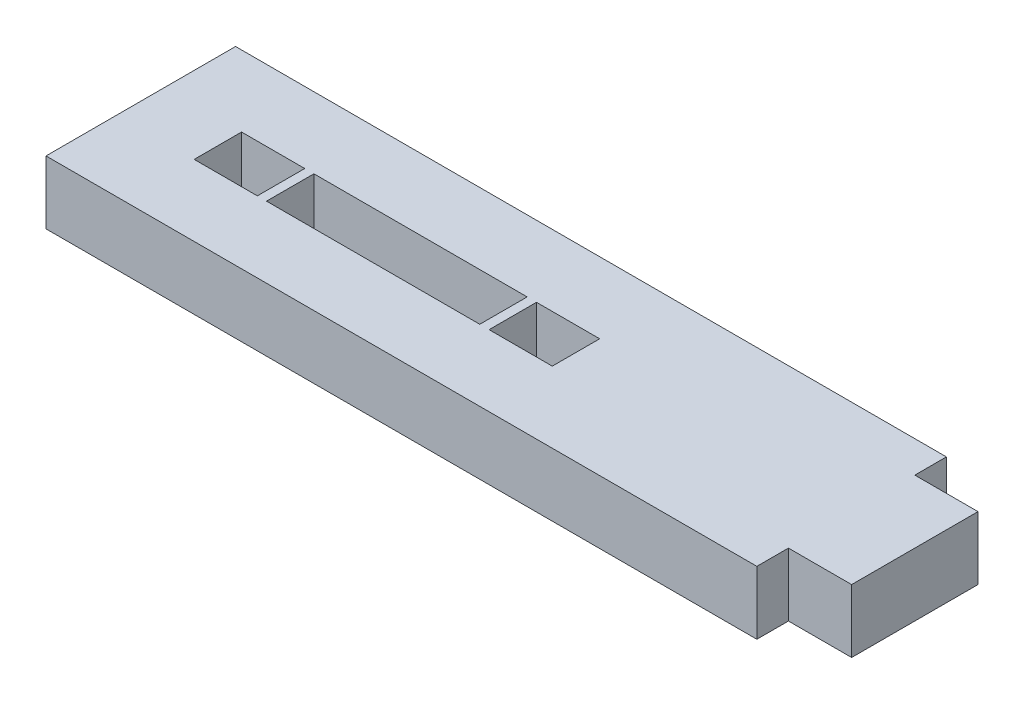
ISO-10303-21;
HEADER;
FILE_DESCRIPTION(('STEP AP214'),'2;1');
FILE_NAME('part.step','',(''),(''),'','','');
FILE_SCHEMA(('AUTOMOTIVE_DESIGN { 1 0 10303 214 1 1 1 1 }'));
ENDSEC;
DATA;
#1=APPLICATION_CONTEXT('core data for automotive mechanical design processes');
#2=APPLICATION_PROTOCOL_DEFINITION('international standard','automotive_design',2000,#1);
#3=PRODUCT_CONTEXT('',#1,'mechanical');
#4=PRODUCT('Part','Part','',(#3));
#5=PRODUCT_RELATED_PRODUCT_CATEGORY('part','',(#4));
#6=PRODUCT_DEFINITION_FORMATION('','',#4);
#7=PRODUCT_DEFINITION_CONTEXT('part definition',#1,'design');
#8=PRODUCT_DEFINITION('design','',#6,#7);
#9=PRODUCT_DEFINITION_SHAPE('','',#8);
#10=(LENGTH_UNIT() NAMED_UNIT(*) SI_UNIT(.MILLI.,.METRE.));
#11=(NAMED_UNIT(*) PLANE_ANGLE_UNIT() SI_UNIT($,.RADIAN.));
#12=(NAMED_UNIT(*) SI_UNIT($,.STERADIAN.) SOLID_ANGLE_UNIT());
#13=UNCERTAINTY_MEASURE_WITH_UNIT(LENGTH_MEASURE(1.E-05),#10,'distance_accuracy_value','');
#14=(GEOMETRIC_REPRESENTATION_CONTEXT(3) GLOBAL_UNCERTAINTY_ASSIGNED_CONTEXT((#13)) GLOBAL_UNIT_ASSIGNED_CONTEXT((#10,
#11,#12)) REPRESENTATION_CONTEXT('',''));
#15=CARTESIAN_POINT('',(0.,0.,0.));
#16=DIRECTION('',(0.,0.,1.));
#17=DIRECTION('',(1.,0.,0.));
#18=AXIS2_PLACEMENT_3D('',#15,#16,#17);
#19=CARTESIAN_POINT('',(0.,4.,0.));
#20=DIRECTION('',(0.,-1.,0.));
#21=DIRECTION('',(0.,0.,-1.));
#22=AXIS2_PLACEMENT_3D('',#19,#20,#21);
#23=PLANE('',#22);
#24=DIRECTION('',(1.,0.,0.));
#25=VECTOR('',#24,1.);
#26=CARTESIAN_POINT('',(1.05,4.,1.5));
#27=LINE('',#26,#25);
#28=CARTESIAN_POINT('',(1.05,4.,1.5));
#29=VERTEX_POINT('',#28);
#30=CARTESIAN_POINT('',(5.05,4.,1.5));
#31=VERTEX_POINT('',#30);
#32=EDGE_CURVE('E205',#29,#31,#27,.T.);
#33=ORIENTED_EDGE('',*,*,#32,.F.);
#34=DIRECTION('',(0.,0.,-1.));
#35=VECTOR('',#34,1.);
#36=CARTESIAN_POINT('',(1.05,4.,1.5));
#37=LINE('',#36,#35);
#38=CARTESIAN_POINT('',(1.05,4.,-1.5));
#39=VERTEX_POINT('',#38);
#40=EDGE_CURVE('E214',#29,#39,#37,.T.);
#41=ORIENTED_EDGE('',*,*,#40,.T.);
#42=DIRECTION('',(1.,0.,0.));
#43=VECTOR('',#42,1.);
#44=CARTESIAN_POINT('',(1.05,4.,-1.5));
#45=LINE('',#44,#43);
#46=CARTESIAN_POINT('',(5.05,4.,-1.5));
#47=VERTEX_POINT('',#46);
#48=EDGE_CURVE('E211',#39,#47,#45,.T.);
#49=ORIENTED_EDGE('',*,*,#48,.T.);
#50=DIRECTION('',(0.,0.,1.));
#51=VECTOR('',#50,1.);
#52=CARTESIAN_POINT('',(5.05,4.,-1.5));
#53=LINE('',#52,#51);
#54=EDGE_CURVE('E207',#47,#31,#53,.T.);
#55=ORIENTED_EDGE('',*,*,#54,.T.);
#56=EDGE_LOOP('',(#33,#41,#49,#55));
#57=FACE_BOUND('',#56,.T.);
#58=DIRECTION('',(0.,0.,-1.));
#59=VECTOR('',#58,1.);
#60=CARTESIAN_POINT('',(22.5,4.,6.));
#61=LINE('',#60,#59);
#62=CARTESIAN_POINT('',(22.5,4.,6.));
#63=VERTEX_POINT('',#62);
#64=CARTESIAN_POINT('',(22.5,4.,4.));
#65=VERTEX_POINT('',#64);
#66=EDGE_CURVE('E297',#63,#65,#61,.T.);
#67=ORIENTED_EDGE('',*,*,#66,.T.);
#68=DIRECTION('',(1.,0.,0.));
#69=VECTOR('',#68,1.);
#70=CARTESIAN_POINT('',(18.5,4.,4.));
#71=LINE('',#70,#69);
#72=CARTESIAN_POINT('',(26.5,4.,4.));
#73=VERTEX_POINT('',#72);
#74=EDGE_CURVE('E276',#65,#73,#71,.T.);
#75=ORIENTED_EDGE('',*,*,#74,.T.);
#76=DIRECTION('',(0.,0.,-1.));
#77=VECTOR('',#76,1.);
#78=CARTESIAN_POINT('',(26.5,4.,4.));
#79=LINE('',#78,#77);
#80=CARTESIAN_POINT('',(26.5,4.,-4.));
#81=VERTEX_POINT('',#80);
#82=EDGE_CURVE('E269',#73,#81,#79,.T.);
#83=ORIENTED_EDGE('',*,*,#82,.T.);
#84=DIRECTION('',(-1.,0.,0.));
#85=VECTOR('',#84,1.);
#86=CARTESIAN_POINT('',(18.5,4.,-4.));
#87=LINE('',#86,#85);
#88=CARTESIAN_POINT('',(22.5,4.,-4.));
#89=VERTEX_POINT('',#88);
#90=EDGE_CURVE('E272',#81,#89,#87,.T.);
#91=ORIENTED_EDGE('',*,*,#90,.T.);
#92=CARTESIAN_POINT('',(22.5,4.,-6.));
#93=VERTEX_POINT('',#92);
#94=EDGE_CURVE('E301',#89,#93,#61,.T.);
#95=ORIENTED_EDGE('',*,*,#94,.T.);
#96=DIRECTION('',(-1.,0.,0.));
#97=VECTOR('',#96,1.);
#98=CARTESIAN_POINT('',(-22.5,4.,-6.));
#99=LINE('',#98,#97);
#100=CARTESIAN_POINT('',(-22.5,4.,-6.));
#101=VERTEX_POINT('',#100);
#102=EDGE_CURVE('E300',#93,#101,#99,.T.);
#103=ORIENTED_EDGE('',*,*,#102,.T.);
#104=DIRECTION('',(0.,0.,1.));
#105=VECTOR('',#104,1.);
#106=CARTESIAN_POINT('',(-22.5,4.,6.));
#107=LINE('',#106,#105);
#108=CARTESIAN_POINT('',(-22.5,4.,6.));
#109=VERTEX_POINT('',#108);
#110=EDGE_CURVE('E303',#101,#109,#107,.T.);
#111=ORIENTED_EDGE('',*,*,#110,.T.);
#112=DIRECTION('',(1.,0.,0.));
#113=VECTOR('',#112,1.);
#114=CARTESIAN_POINT('',(-22.5,4.,6.));
#115=LINE('',#114,#113);
#116=EDGE_CURVE('E305',#109,#63,#115,.T.);
#117=ORIENTED_EDGE('',*,*,#116,.T.);
#118=EDGE_LOOP('',(#67,#75,#83,#91,#95,#103,#111,#117));
#119=FACE_BOUND('',#118,.T.);
#120=DIRECTION('',(1.,0.,0.));
#121=VECTOR('',#120,1.);
#122=CARTESIAN_POINT('',(0.,4.,1.5));
#123=LINE('',#122,#121);
#124=CARTESIAN_POINT('',(-13.04,4.,1.5));
#125=VERTEX_POINT('',#124);
#126=CARTESIAN_POINT('',(0.460000000000004,4.,1.5));
#127=VERTEX_POINT('',#126);
#128=EDGE_CURVE('E237',#125,#127,#123,.T.);
#129=ORIENTED_EDGE('',*,*,#128,.F.);
#130=DIRECTION('',(0.,0.,-1.));
#131=VECTOR('',#130,1.);
#132=CARTESIAN_POINT('',(-13.04,4.,0.));
#133=LINE('',#132,#131);
#134=CARTESIAN_POINT('',(-13.04,4.,-1.5));
#135=VERTEX_POINT('',#134);
#136=EDGE_CURVE('E245',#125,#135,#133,.T.);
#137=ORIENTED_EDGE('',*,*,#136,.T.);
#138=DIRECTION('',(1.,0.,0.));
#139=VECTOR('',#138,1.);
#140=CARTESIAN_POINT('',(0.,4.,-1.5));
#141=LINE('',#140,#139);
#142=CARTESIAN_POINT('',(0.460000000000004,4.,-1.5));
#143=VERTEX_POINT('',#142);
#144=EDGE_CURVE('E242',#135,#143,#141,.T.);
#145=ORIENTED_EDGE('',*,*,#144,.T.);
#146=DIRECTION('',(0.,0.,-1.));
#147=VECTOR('',#146,1.);
#148=CARTESIAN_POINT('',(0.460000000000004,4.,0.));
#149=LINE('',#148,#147);
#150=EDGE_CURVE('E239',#127,#143,#149,.T.);
#151=ORIENTED_EDGE('',*,*,#150,.F.);
#152=EDGE_LOOP('',(#129,#137,#145,#151));
#153=FACE_BOUND('',#152,.T.);
#154=DIRECTION('',(1.,0.,0.));
#155=VECTOR('',#154,1.);
#156=CARTESIAN_POINT('',(-17.62,4.,1.5));
#157=LINE('',#156,#155);
#158=CARTESIAN_POINT('',(-17.62,4.,1.5));
#159=VERTEX_POINT('',#158);
#160=CARTESIAN_POINT('',(-13.62,4.,1.5));
#161=VERTEX_POINT('',#160);
#162=EDGE_CURVE('E168',#159,#161,#157,.T.);
#163=ORIENTED_EDGE('',*,*,#162,.F.);
#164=DIRECTION('',(0.,0.,-1.));
#165=VECTOR('',#164,1.);
#166=CARTESIAN_POINT('',(-17.62,4.,1.5));
#167=LINE('',#166,#165);
#168=CARTESIAN_POINT('',(-17.62,4.,-1.5));
#169=VERTEX_POINT('',#168);
#170=EDGE_CURVE('E190',#159,#169,#167,.T.);
#171=ORIENTED_EDGE('',*,*,#170,.T.);
#172=DIRECTION('',(1.,0.,0.));
#173=VECTOR('',#172,1.);
#174=CARTESIAN_POINT('',(-17.62,4.,-1.5));
#175=LINE('',#174,#173);
#176=CARTESIAN_POINT('',(-13.62,4.,-1.5));
#177=VERTEX_POINT('',#176);
#178=EDGE_CURVE('E48',#169,#177,#175,.T.);
#179=ORIENTED_EDGE('',*,*,#178,.T.);
#180=DIRECTION('',(0.,0.,1.));
#181=VECTOR('',#180,1.);
#182=CARTESIAN_POINT('',(-13.62,4.,-1.5));
#183=LINE('',#182,#181);
#184=EDGE_CURVE('E178',#177,#161,#183,.T.);
#185=ORIENTED_EDGE('',*,*,#184,.T.);
#186=EDGE_LOOP('',(#163,#171,#179,#185));
#187=FACE_BOUND('',#186,.T.);
#188=ADVANCED_FACE('F33',(#57,#119,#153,#187),#23,.F.);
#189=CARTESIAN_POINT('',(0.,0.,0.));
#190=DIRECTION('',(0.,-1.,0.));
#191=DIRECTION('',(0.,0.,-1.));
#192=AXIS2_PLACEMENT_3D('',#189,#190,#191);
#193=PLANE('',#192);
#194=DIRECTION('',(0.,0.,-1.));
#195=VECTOR('',#194,1.);
#196=CARTESIAN_POINT('',(22.5,0.,6.));
#197=LINE('',#196,#195);
#198=CARTESIAN_POINT('',(22.5,0.,-4.));
#199=VERTEX_POINT('',#198);
#200=CARTESIAN_POINT('',(22.5,0.,-6.));
#201=VERTEX_POINT('',#200);
#202=EDGE_CURVE('E296',#199,#201,#197,.T.);
#203=ORIENTED_EDGE('',*,*,#202,.F.);
#204=DIRECTION('',(-1.,0.,0.));
#205=VECTOR('',#204,1.);
#206=CARTESIAN_POINT('',(18.5,0.,-4.));
#207=LINE('',#206,#205);
#208=CARTESIAN_POINT('',(26.5,0.,-4.));
#209=VERTEX_POINT('',#208);
#210=EDGE_CURVE('E281',#209,#199,#207,.T.);
#211=ORIENTED_EDGE('',*,*,#210,.F.);
#212=DIRECTION('',(0.,0.,-1.));
#213=VECTOR('',#212,1.);
#214=CARTESIAN_POINT('',(26.5,0.,4.));
#215=LINE('',#214,#213);
#216=CARTESIAN_POINT('',(26.5,0.,4.));
#217=VERTEX_POINT('',#216);
#218=EDGE_CURVE('E268',#217,#209,#215,.T.);
#219=ORIENTED_EDGE('',*,*,#218,.F.);
#220=DIRECTION('',(1.,0.,0.));
#221=VECTOR('',#220,1.);
#222=CARTESIAN_POINT('',(18.5,0.,4.));
#223=LINE('',#222,#221);
#224=CARTESIAN_POINT('',(22.5,0.,4.));
#225=VERTEX_POINT('',#224);
#226=EDGE_CURVE('E273',#225,#217,#223,.T.);
#227=ORIENTED_EDGE('',*,*,#226,.F.);
#228=CARTESIAN_POINT('',(22.5,0.,6.));
#229=VERTEX_POINT('',#228);
#230=EDGE_CURVE('E308',#229,#225,#197,.T.);
#231=ORIENTED_EDGE('',*,*,#230,.F.);
#232=DIRECTION('',(1.,0.,0.));
#233=VECTOR('',#232,1.);
#234=CARTESIAN_POINT('',(-22.5,0.,6.));
#235=LINE('',#234,#233);
#236=CARTESIAN_POINT('',(-22.5,0.,6.));
#237=VERTEX_POINT('',#236);
#238=EDGE_CURVE('E314',#237,#229,#235,.T.);
#239=ORIENTED_EDGE('',*,*,#238,.F.);
#240=DIRECTION('',(0.,0.,1.));
#241=VECTOR('',#240,1.);
#242=CARTESIAN_POINT('',(-22.5,0.,6.));
#243=LINE('',#242,#241);
#244=CARTESIAN_POINT('',(-22.5,0.,-6.));
#245=VERTEX_POINT('',#244);
#246=EDGE_CURVE('E312',#245,#237,#243,.T.);
#247=ORIENTED_EDGE('',*,*,#246,.F.);
#248=DIRECTION('',(-1.,0.,0.));
#249=VECTOR('',#248,1.);
#250=CARTESIAN_POINT('',(-22.5,0.,-6.));
#251=LINE('',#250,#249);
#252=EDGE_CURVE('E310',#201,#245,#251,.T.);
#253=ORIENTED_EDGE('',*,*,#252,.F.);
#254=EDGE_LOOP('',(#203,#211,#219,#227,#231,#239,#247,#253));
#255=FACE_BOUND('',#254,.T.);
#256=DIRECTION('',(0.,0.,-1.));
#257=VECTOR('',#256,1.);
#258=CARTESIAN_POINT('',(-13.04,0.,0.));
#259=LINE('',#258,#257);
#260=CARTESIAN_POINT('',(-13.04,0.,1.5));
#261=VERTEX_POINT('',#260);
#262=CARTESIAN_POINT('',(-13.04,0.,-1.5));
#263=VERTEX_POINT('',#262);
#264=EDGE_CURVE('E240',#261,#263,#259,.T.);
#265=ORIENTED_EDGE('',*,*,#264,.F.);
#266=DIRECTION('',(1.,0.,0.));
#267=VECTOR('',#266,1.);
#268=CARTESIAN_POINT('',(0.,0.,1.5));
#269=LINE('',#268,#267);
#270=CARTESIAN_POINT('',(0.460000000000004,0.,1.5));
#271=VERTEX_POINT('',#270);
#272=EDGE_CURVE('E236',#261,#271,#269,.T.);
#273=ORIENTED_EDGE('',*,*,#272,.T.);
#274=DIRECTION('',(0.,0.,-1.));
#275=VECTOR('',#274,1.);
#276=CARTESIAN_POINT('',(0.460000000000004,0.,0.));
#277=LINE('',#276,#275);
#278=CARTESIAN_POINT('',(0.460000000000004,0.,-1.5));
#279=VERTEX_POINT('',#278);
#280=EDGE_CURVE('E251',#271,#279,#277,.T.);
#281=ORIENTED_EDGE('',*,*,#280,.T.);
#282=DIRECTION('',(1.,0.,0.));
#283=VECTOR('',#282,1.);
#284=CARTESIAN_POINT('',(0.,0.,-1.5));
#285=LINE('',#284,#283);
#286=EDGE_CURVE('E254',#263,#279,#285,.T.);
#287=ORIENTED_EDGE('',*,*,#286,.F.);
#288=EDGE_LOOP('',(#265,#273,#281,#287));
#289=FACE_BOUND('',#288,.T.);
#290=DIRECTION('',(0.,0.,-1.));
#291=VECTOR('',#290,1.);
#292=CARTESIAN_POINT('',(1.05,0.,1.5));
#293=LINE('',#292,#291);
#294=CARTESIAN_POINT('',(1.05,0.,1.5));
#295=VERTEX_POINT('',#294);
#296=CARTESIAN_POINT('',(1.05,0.,-1.5));
#297=VERTEX_POINT('',#296);
#298=EDGE_CURVE('E208',#295,#297,#293,.T.);
#299=ORIENTED_EDGE('',*,*,#298,.F.);
#300=DIRECTION('',(1.,0.,0.));
#301=VECTOR('',#300,1.);
#302=CARTESIAN_POINT('',(1.05,0.,1.5));
#303=LINE('',#302,#301);
#304=CARTESIAN_POINT('',(5.05,0.,1.5));
#305=VERTEX_POINT('',#304);
#306=EDGE_CURVE('E186',#295,#305,#303,.T.);
#307=ORIENTED_EDGE('',*,*,#306,.T.);
#308=DIRECTION('',(0.,0.,1.));
#309=VECTOR('',#308,1.);
#310=CARTESIAN_POINT('',(5.05,0.,-1.5));
#311=LINE('',#310,#309);
#312=CARTESIAN_POINT('',(5.05,0.,-1.5));
#313=VERTEX_POINT('',#312);
#314=EDGE_CURVE('E220',#313,#305,#311,.T.);
#315=ORIENTED_EDGE('',*,*,#314,.F.);
#316=DIRECTION('',(1.,0.,0.));
#317=VECTOR('',#316,1.);
#318=CARTESIAN_POINT('',(1.05,0.,-1.5));
#319=LINE('',#318,#317);
#320=EDGE_CURVE('E223',#297,#313,#319,.T.);
#321=ORIENTED_EDGE('',*,*,#320,.F.);
#322=EDGE_LOOP('',(#299,#307,#315,#321));
#323=FACE_BOUND('',#322,.T.);
#324=DIRECTION('',(0.,0.,-1.));
#325=VECTOR('',#324,1.);
#326=CARTESIAN_POINT('',(-17.62,0.,1.5));
#327=LINE('',#326,#325);
#328=CARTESIAN_POINT('',(-17.62,0.,1.5));
#329=VERTEX_POINT('',#328);
#330=CARTESIAN_POINT('',(-17.62,0.,-1.5));
#331=VERTEX_POINT('',#330);
#332=EDGE_CURVE('E179',#329,#331,#327,.T.);
#333=ORIENTED_EDGE('',*,*,#332,.F.);
#334=DIRECTION('',(1.,0.,0.));
#335=VECTOR('',#334,1.);
#336=CARTESIAN_POINT('',(-17.62,0.,1.5));
#337=LINE('',#336,#335);
#338=CARTESIAN_POINT('',(-13.62,0.,1.5));
#339=VERTEX_POINT('',#338);
#340=EDGE_CURVE('E56',#329,#339,#337,.T.);
#341=ORIENTED_EDGE('',*,*,#340,.T.);
#342=DIRECTION('',(0.,0.,1.));
#343=VECTOR('',#342,1.);
#344=CARTESIAN_POINT('',(-13.62,0.,-1.5));
#345=LINE('',#344,#343);
#346=CARTESIAN_POINT('',(-13.62,0.,-1.5));
#347=VERTEX_POINT('',#346);
#348=EDGE_CURVE('E185',#347,#339,#345,.T.);
#349=ORIENTED_EDGE('',*,*,#348,.F.);
#350=DIRECTION('',(1.,0.,0.));
#351=VECTOR('',#350,1.);
#352=CARTESIAN_POINT('',(-17.62,0.,-1.5));
#353=LINE('',#352,#351);
#354=EDGE_CURVE('E196',#331,#347,#353,.T.);
#355=ORIENTED_EDGE('',*,*,#354,.F.);
#356=EDGE_LOOP('',(#333,#341,#349,#355));
#357=FACE_BOUND('',#356,.T.);
#358=ADVANCED_FACE('F332',(#255,#289,#323,#357),#193,.T.);
#359=CARTESIAN_POINT('',(22.5,4.,6.));
#360=DIRECTION('',(-1.,0.,0.));
#361=DIRECTION('',(0.,0.,1.));
#362=AXIS2_PLACEMENT_3D('',#359,#360,#361);
#363=PLANE('',#362);
#364=DIRECTION('',(0.,1.,0.));
#365=VECTOR('',#364,1.);
#366=CARTESIAN_POINT('',(22.5,4.,-4.));
#367=LINE('',#366,#365);
#368=EDGE_CURVE('E293',#199,#89,#367,.T.);
#369=ORIENTED_EDGE('',*,*,#368,.F.);
#370=ORIENTED_EDGE('',*,*,#202,.T.);
#371=DIRECTION('',(0.,-1.,0.));
#372=VECTOR('',#371,1.);
#373=CARTESIAN_POINT('',(22.5,4.,-6.));
#374=LINE('',#373,#372);
#375=EDGE_CURVE('E11',#93,#201,#374,.T.);
#376=ORIENTED_EDGE('',*,*,#375,.F.);
#377=ORIENTED_EDGE('',*,*,#94,.F.);
#378=EDGE_LOOP('',(#369,#370,#376,#377));
#379=FACE_BOUND('',#378,.T.);
#380=ADVANCED_FACE('F35',(#379),#363,.F.);
#381=DIRECTION('',(0.,-1.,0.));
#382=VECTOR('',#381,1.);
#383=CARTESIAN_POINT('',(22.5,4.,4.));
#384=LINE('',#383,#382);
#385=EDGE_CURVE('E290',#65,#225,#384,.T.);
#386=ORIENTED_EDGE('',*,*,#385,.F.);
#387=ORIENTED_EDGE('',*,*,#66,.F.);
#388=DIRECTION('',(0.,-1.,0.));
#389=VECTOR('',#388,1.);
#390=CARTESIAN_POINT('',(22.5,4.,6.));
#391=LINE('',#390,#389);
#392=EDGE_CURVE('E307',#63,#229,#391,.T.);
#393=ORIENTED_EDGE('',*,*,#392,.T.);
#394=ORIENTED_EDGE('',*,*,#230,.T.);
#395=EDGE_LOOP('',(#386,#387,#393,#394));
#396=FACE_BOUND('',#395,.T.);
#397=ADVANCED_FACE('F342',(#396),#363,.F.);
#398=CARTESIAN_POINT('',(-22.5,4.,-6.));
#399=DIRECTION('',(0.,0.,1.));
#400=DIRECTION('',(1.,0.,0.));
#401=AXIS2_PLACEMENT_3D('',#398,#399,#400);
#402=PLANE('',#401);
#403=ORIENTED_EDGE('',*,*,#252,.T.);
#404=DIRECTION('',(0.,-1.,0.));
#405=VECTOR('',#404,1.);
#406=CARTESIAN_POINT('',(-22.5,4.,-6.));
#407=LINE('',#406,#405);
#408=EDGE_CURVE('E41',#101,#245,#407,.T.);
#409=ORIENTED_EDGE('',*,*,#408,.F.);
#410=ORIENTED_EDGE('',*,*,#102,.F.);
#411=ORIENTED_EDGE('',*,*,#375,.T.);
#412=EDGE_LOOP('',(#403,#409,#410,#411));
#413=FACE_BOUND('',#412,.T.);
#414=ADVANCED_FACE('F359',(#413),#402,.F.);
#415=CARTESIAN_POINT('',(-22.5,4.,6.));
#416=DIRECTION('',(1.,0.,0.));
#417=DIRECTION('',(0.,0.,-1.));
#418=AXIS2_PLACEMENT_3D('',#415,#416,#417);
#419=PLANE('',#418);
#420=ORIENTED_EDGE('',*,*,#246,.T.);
#421=DIRECTION('',(0.,-1.,0.));
#422=VECTOR('',#421,1.);
#423=CARTESIAN_POINT('',(-22.5,4.,6.));
#424=LINE('',#423,#422);
#425=EDGE_CURVE('E318',#109,#237,#424,.T.);
#426=ORIENTED_EDGE('',*,*,#425,.F.);
#427=ORIENTED_EDGE('',*,*,#110,.F.);
#428=ORIENTED_EDGE('',*,*,#408,.T.);
#429=EDGE_LOOP('',(#420,#426,#427,#428));
#430=FACE_BOUND('',#429,.T.);
#431=ADVANCED_FACE('F325',(#430),#419,.F.);
#432=CARTESIAN_POINT('',(-22.5,4.,6.));
#433=DIRECTION('',(0.,0.,-1.));
#434=DIRECTION('',(-1.,0.,0.));
#435=AXIS2_PLACEMENT_3D('',#432,#433,#434);
#436=PLANE('',#435);
#437=ORIENTED_EDGE('',*,*,#238,.T.);
#438=ORIENTED_EDGE('',*,*,#392,.F.);
#439=ORIENTED_EDGE('',*,*,#116,.F.);
#440=ORIENTED_EDGE('',*,*,#425,.T.);
#441=EDGE_LOOP('',(#437,#438,#439,#440));
#442=FACE_BOUND('',#441,.T.);
#443=ADVANCED_FACE('F338',(#442),#436,.F.);
#444=CARTESIAN_POINT('',(18.5,4.,-4.));
#445=DIRECTION('',(0.,0.,1.));
#446=DIRECTION('',(1.,0.,0.));
#447=AXIS2_PLACEMENT_3D('',#444,#445,#446);
#448=PLANE('',#447);
#449=ORIENTED_EDGE('',*,*,#210,.T.);
#450=ORIENTED_EDGE('',*,*,#368,.T.);
#451=ORIENTED_EDGE('',*,*,#90,.F.);
#452=DIRECTION('',(0.,-1.,0.));
#453=VECTOR('',#452,1.);
#454=CARTESIAN_POINT('',(26.5,4.,-4.));
#455=LINE('',#454,#453);
#456=EDGE_CURVE('E287',#81,#209,#455,.T.);
#457=ORIENTED_EDGE('',*,*,#456,.T.);
#458=EDGE_LOOP('',(#449,#450,#451,#457));
#459=FACE_BOUND('',#458,.T.);
#460=ADVANCED_FACE('F355',(#459),#448,.F.);
#461=CARTESIAN_POINT('',(18.5,4.,4.));
#462=DIRECTION('',(0.,0.,-1.));
#463=DIRECTION('',(-1.,0.,0.));
#464=AXIS2_PLACEMENT_3D('',#461,#462,#463);
#465=PLANE('',#464);
#466=ORIENTED_EDGE('',*,*,#74,.F.);
#467=ORIENTED_EDGE('',*,*,#385,.T.);
#468=ORIENTED_EDGE('',*,*,#226,.T.);
#469=DIRECTION('',(0.,-1.,0.));
#470=VECTOR('',#469,1.);
#471=CARTESIAN_POINT('',(26.5,4.,4.));
#472=LINE('',#471,#470);
#473=EDGE_CURVE('E278',#73,#217,#472,.T.);
#474=ORIENTED_EDGE('',*,*,#473,.F.);
#475=EDGE_LOOP('',(#466,#467,#468,#474));
#476=FACE_BOUND('',#475,.T.);
#477=ADVANCED_FACE('F348',(#476),#465,.F.);
#478=CARTESIAN_POINT('',(26.5,4.,4.));
#479=DIRECTION('',(-1.,0.,0.));
#480=DIRECTION('',(0.,0.,1.));
#481=AXIS2_PLACEMENT_3D('',#478,#479,#480);
#482=PLANE('',#481);
#483=ORIENTED_EDGE('',*,*,#218,.T.);
#484=ORIENTED_EDGE('',*,*,#456,.F.);
#485=ORIENTED_EDGE('',*,*,#82,.F.);
#486=ORIENTED_EDGE('',*,*,#473,.T.);
#487=EDGE_LOOP('',(#483,#484,#485,#486));
#488=FACE_BOUND('',#487,.T.);
#489=ADVANCED_FACE('F353',(#488),#482,.F.);
#490=CARTESIAN_POINT('',(0.,4.,1.5));
#491=DIRECTION('',(0.,0.,-1.));
#492=DIRECTION('',(-1.,0.,0.));
#493=AXIS2_PLACEMENT_3D('',#490,#491,#492);
#494=PLANE('',#493);
#495=ORIENTED_EDGE('',*,*,#272,.F.);
#496=DIRECTION('',(0.,-1.,0.));
#497=VECTOR('',#496,1.);
#498=CARTESIAN_POINT('',(-13.04,4.,1.5));
#499=LINE('',#498,#497);
#500=EDGE_CURVE('E248',#125,#261,#499,.T.);
#501=ORIENTED_EDGE('',*,*,#500,.F.);
#502=ORIENTED_EDGE('',*,*,#128,.T.);
#503=DIRECTION('',(0.,-1.,0.));
#504=VECTOR('',#503,1.);
#505=CARTESIAN_POINT('',(0.460000000000004,4.,1.5));
#506=LINE('',#505,#504);
#507=EDGE_CURVE('E265',#127,#271,#506,.T.);
#508=ORIENTED_EDGE('',*,*,#507,.T.);
#509=EDGE_LOOP('',(#495,#501,#502,#508));
#510=FACE_BOUND('',#509,.T.);
#511=ADVANCED_FACE('F386',(#510),#494,.T.);
#512=CARTESIAN_POINT('',(0.460000000000004,4.,0.));
#513=DIRECTION('',(-1.,0.,0.));
#514=DIRECTION('',(0.,0.,1.));
#515=AXIS2_PLACEMENT_3D('',#512,#513,#514);
#516=PLANE('',#515);
#517=ORIENTED_EDGE('',*,*,#280,.F.);
#518=ORIENTED_EDGE('',*,*,#507,.F.);
#519=ORIENTED_EDGE('',*,*,#150,.T.);
#520=DIRECTION('',(0.,-1.,0.));
#521=VECTOR('',#520,1.);
#522=CARTESIAN_POINT('',(0.460000000000004,4.,-1.5));
#523=LINE('',#522,#521);
#524=EDGE_CURVE('E263',#143,#279,#523,.T.);
#525=ORIENTED_EDGE('',*,*,#524,.T.);
#526=EDGE_LOOP('',(#517,#518,#519,#525));
#527=FACE_BOUND('',#526,.T.);
#528=ADVANCED_FACE('F389',(#527),#516,.T.);
#529=CARTESIAN_POINT('',(0.,4.,-1.5));
#530=DIRECTION('',(0.,0.,-1.));
#531=DIRECTION('',(-1.,0.,0.));
#532=AXIS2_PLACEMENT_3D('',#529,#530,#531);
#533=PLANE('',#532);
#534=ORIENTED_EDGE('',*,*,#286,.T.);
#535=ORIENTED_EDGE('',*,*,#524,.F.);
#536=ORIENTED_EDGE('',*,*,#144,.F.);
#537=DIRECTION('',(0.,-1.,0.));
#538=VECTOR('',#537,1.);
#539=CARTESIAN_POINT('',(-13.04,4.,-1.5));
#540=LINE('',#539,#538);
#541=EDGE_CURVE('E261',#135,#263,#540,.T.);
#542=ORIENTED_EDGE('',*,*,#541,.T.);
#543=EDGE_LOOP('',(#534,#535,#536,#542));
#544=FACE_BOUND('',#543,.T.);
#545=ADVANCED_FACE('F393',(#544),#533,.F.);
#546=CARTESIAN_POINT('',(-13.04,4.,0.));
#547=DIRECTION('',(-1.,0.,0.));
#548=DIRECTION('',(0.,0.,1.));
#549=AXIS2_PLACEMENT_3D('',#546,#547,#548);
#550=PLANE('',#549);
#551=ORIENTED_EDGE('',*,*,#264,.T.);
#552=ORIENTED_EDGE('',*,*,#541,.F.);
#553=ORIENTED_EDGE('',*,*,#136,.F.);
#554=ORIENTED_EDGE('',*,*,#500,.T.);
#555=EDGE_LOOP('',(#551,#552,#553,#554));
#556=FACE_BOUND('',#555,.T.);
#557=ADVANCED_FACE('F397',(#556),#550,.F.);
#558=CARTESIAN_POINT('',(1.05,4.,1.5));
#559=DIRECTION('',(0.,0.,-1.));
#560=DIRECTION('',(-1.,0.,0.));
#561=AXIS2_PLACEMENT_3D('',#558,#559,#560);
#562=PLANE('',#561);
#563=ORIENTED_EDGE('',*,*,#306,.F.);
#564=DIRECTION('',(0.,-1.,0.));
#565=VECTOR('',#564,1.);
#566=CARTESIAN_POINT('',(1.05,4.,1.5));
#567=LINE('',#566,#565);
#568=EDGE_CURVE('E217',#29,#295,#567,.T.);
#569=ORIENTED_EDGE('',*,*,#568,.F.);
#570=ORIENTED_EDGE('',*,*,#32,.T.);
#571=DIRECTION('',(0.,-1.,0.));
#572=VECTOR('',#571,1.);
#573=CARTESIAN_POINT('',(5.05,4.,1.5));
#574=LINE('',#573,#572);
#575=EDGE_CURVE('E234',#31,#305,#574,.T.);
#576=ORIENTED_EDGE('',*,*,#575,.T.);
#577=EDGE_LOOP('',(#563,#569,#570,#576));
#578=FACE_BOUND('',#577,.T.);
#579=ADVANCED_FACE('F401',(#578),#562,.T.);
#580=CARTESIAN_POINT('',(5.05,4.,-1.5));
#581=DIRECTION('',(1.,0.,0.));
#582=DIRECTION('',(0.,0.,-1.));
#583=AXIS2_PLACEMENT_3D('',#580,#581,#582);
#584=PLANE('',#583);
#585=ORIENTED_EDGE('',*,*,#314,.T.);
#586=ORIENTED_EDGE('',*,*,#575,.F.);
#587=ORIENTED_EDGE('',*,*,#54,.F.);
#588=DIRECTION('',(0.,-1.,0.));
#589=VECTOR('',#588,1.);
#590=CARTESIAN_POINT('',(5.05,4.,-1.5));
#591=LINE('',#590,#589);
#592=EDGE_CURVE('E232',#47,#313,#591,.T.);
#593=ORIENTED_EDGE('',*,*,#592,.T.);
#594=EDGE_LOOP('',(#585,#586,#587,#593));
#595=FACE_BOUND('',#594,.T.);
#596=ADVANCED_FACE('F405',(#595),#584,.F.);
#597=CARTESIAN_POINT('',(1.05,4.,-1.5));
#598=DIRECTION('',(0.,0.,-1.));
#599=DIRECTION('',(-1.,0.,0.));
#600=AXIS2_PLACEMENT_3D('',#597,#598,#599);
#601=PLANE('',#600);
#602=ORIENTED_EDGE('',*,*,#320,.T.);
#603=ORIENTED_EDGE('',*,*,#592,.F.);
#604=ORIENTED_EDGE('',*,*,#48,.F.);
#605=DIRECTION('',(0.,-1.,0.));
#606=VECTOR('',#605,1.);
#607=CARTESIAN_POINT('',(1.05,4.,-1.5));
#608=LINE('',#607,#606);
#609=EDGE_CURVE('E230',#39,#297,#608,.T.);
#610=ORIENTED_EDGE('',*,*,#609,.T.);
#611=EDGE_LOOP('',(#602,#603,#604,#610));
#612=FACE_BOUND('',#611,.T.);
#613=ADVANCED_FACE('F409',(#612),#601,.F.);
#614=CARTESIAN_POINT('',(1.05,4.,1.5));
#615=DIRECTION('',(-1.,0.,0.));
#616=DIRECTION('',(0.,0.,1.));
#617=AXIS2_PLACEMENT_3D('',#614,#615,#616);
#618=PLANE('',#617);
#619=ORIENTED_EDGE('',*,*,#298,.T.);
#620=ORIENTED_EDGE('',*,*,#609,.F.);
#621=ORIENTED_EDGE('',*,*,#40,.F.);
#622=ORIENTED_EDGE('',*,*,#568,.T.);
#623=EDGE_LOOP('',(#619,#620,#621,#622));
#624=FACE_BOUND('',#623,.T.);
#625=ADVANCED_FACE('F413',(#624),#618,.F.);
#626=CARTESIAN_POINT('',(-17.62,4.,1.5));
#627=DIRECTION('',(0.,0.,-1.));
#628=DIRECTION('',(-1.,0.,0.));
#629=AXIS2_PLACEMENT_3D('',#626,#627,#628);
#630=PLANE('',#629);
#631=ORIENTED_EDGE('',*,*,#340,.F.);
#632=DIRECTION('',(0.,-1.,0.));
#633=VECTOR('',#632,1.);
#634=CARTESIAN_POINT('',(-17.62,4.,1.5));
#635=LINE('',#634,#633);
#636=EDGE_CURVE('E173',#159,#329,#635,.T.);
#637=ORIENTED_EDGE('',*,*,#636,.F.);
#638=ORIENTED_EDGE('',*,*,#162,.T.);
#639=DIRECTION('',(0.,-1.,0.));
#640=VECTOR('',#639,1.);
#641=CARTESIAN_POINT('',(-13.62,4.,1.5));
#642=LINE('',#641,#640);
#643=EDGE_CURVE('E171',#161,#339,#642,.T.);
#644=ORIENTED_EDGE('',*,*,#643,.T.);
#645=EDGE_LOOP('',(#631,#637,#638,#644));
#646=FACE_BOUND('',#645,.T.);
#647=ADVANCED_FACE('F170',(#646),#630,.T.);
#648=CARTESIAN_POINT('',(-13.62,4.,-1.5));
#649=DIRECTION('',(1.,0.,0.));
#650=DIRECTION('',(0.,0.,-1.));
#651=AXIS2_PLACEMENT_3D('',#648,#649,#650);
#652=PLANE('',#651);
#653=ORIENTED_EDGE('',*,*,#348,.T.);
#654=ORIENTED_EDGE('',*,*,#643,.F.);
#655=ORIENTED_EDGE('',*,*,#184,.F.);
#656=DIRECTION('',(0.,-1.,0.));
#657=VECTOR('',#656,1.);
#658=CARTESIAN_POINT('',(-13.62,4.,-1.5));
#659=LINE('',#658,#657);
#660=EDGE_CURVE('E187',#177,#347,#659,.T.);
#661=ORIENTED_EDGE('',*,*,#660,.T.);
#662=EDGE_LOOP('',(#653,#654,#655,#661));
#663=FACE_BOUND('',#662,.T.);
#664=ADVANCED_FACE('F183',(#663),#652,.F.);
#665=CARTESIAN_POINT('',(-17.62,4.,-1.5));
#666=DIRECTION('',(0.,0.,-1.));
#667=DIRECTION('',(-1.,0.,0.));
#668=AXIS2_PLACEMENT_3D('',#665,#666,#667);
#669=PLANE('',#668);
#670=ORIENTED_EDGE('',*,*,#354,.T.);
#671=ORIENTED_EDGE('',*,*,#660,.F.);
#672=ORIENTED_EDGE('',*,*,#178,.F.);
#673=DIRECTION('',(0.,-1.,0.));
#674=VECTOR('',#673,1.);
#675=CARTESIAN_POINT('',(-17.62,4.,-1.5));
#676=LINE('',#675,#674);
#677=EDGE_CURVE('E202',#169,#331,#676,.T.);
#678=ORIENTED_EDGE('',*,*,#677,.T.);
#679=EDGE_LOOP('',(#670,#671,#672,#678));
#680=FACE_BOUND('',#679,.T.);
#681=ADVANCED_FACE('F422',(#680),#669,.F.);
#682=CARTESIAN_POINT('',(-17.62,4.,1.5));
#683=DIRECTION('',(-1.,0.,0.));
#684=DIRECTION('',(0.,0.,1.));
#685=AXIS2_PLACEMENT_3D('',#682,#683,#684);
#686=PLANE('',#685);
#687=ORIENTED_EDGE('',*,*,#332,.T.);
#688=ORIENTED_EDGE('',*,*,#677,.F.);
#689=ORIENTED_EDGE('',*,*,#170,.F.);
#690=ORIENTED_EDGE('',*,*,#636,.T.);
#691=EDGE_LOOP('',(#687,#688,#689,#690));
#692=FACE_BOUND('',#691,.T.);
#693=ADVANCED_FACE('F425',(#692),#686,.F.);
#694=CLOSED_SHELL('',(#188,#358,#380,#397,#414,#431,#443,#460,#477,#489,#511,#528,#545,#557,
#579,#596,#613,#625,#647,#664,#681,#693));
#695=MANIFOLD_SOLID_BREP('B2',#694);
#696=ADVANCED_BREP_SHAPE_REPRESENTATION('',(#18,#695),#14);
#697=SHAPE_DEFINITION_REPRESENTATION(#9,#696);
ENDSEC;
END-ISO-10303-21;
